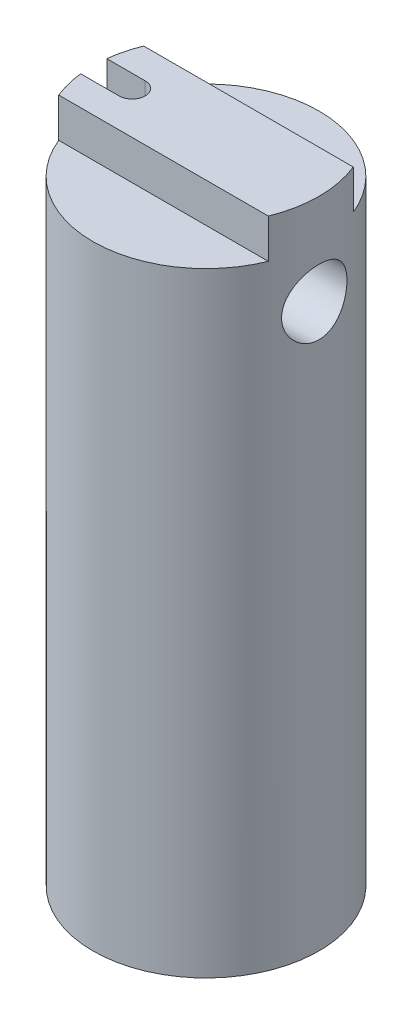
ISO-10303-21;
HEADER;
FILE_DESCRIPTION(('STEP AP214'),'2;1');
FILE_NAME('part.step','',(''),(''),'','','');
FILE_SCHEMA(('AUTOMOTIVE_DESIGN { 1 0 10303 214 1 1 1 1 }'));
ENDSEC;
DATA;
#1=APPLICATION_CONTEXT('core data for automotive mechanical design processes');
#2=APPLICATION_PROTOCOL_DEFINITION('international standard','automotive_design',2000,#1);
#3=PRODUCT_CONTEXT('',#1,'mechanical');
#4=PRODUCT('Part','Part','',(#3));
#5=PRODUCT_RELATED_PRODUCT_CATEGORY('part','',(#4));
#6=PRODUCT_DEFINITION_FORMATION('','',#4);
#7=PRODUCT_DEFINITION_CONTEXT('part definition',#1,'design');
#8=PRODUCT_DEFINITION('design','',#6,#7);
#9=PRODUCT_DEFINITION_SHAPE('','',#8);
#10=(LENGTH_UNIT() NAMED_UNIT(*) SI_UNIT(.MILLI.,.METRE.));
#11=(NAMED_UNIT(*) PLANE_ANGLE_UNIT() SI_UNIT($,.RADIAN.));
#12=(NAMED_UNIT(*) SI_UNIT($,.STERADIAN.) SOLID_ANGLE_UNIT());
#13=UNCERTAINTY_MEASURE_WITH_UNIT(LENGTH_MEASURE(1.E-05),#10,'distance_accuracy_value','');
#14=(GEOMETRIC_REPRESENTATION_CONTEXT(3) GLOBAL_UNCERTAINTY_ASSIGNED_CONTEXT((#13)) GLOBAL_UNIT_ASSIGNED_CONTEXT((#10,
#11,#12)) REPRESENTATION_CONTEXT('',''));
#15=CARTESIAN_POINT('',(0.,0.,0.));
#16=DIRECTION('',(0.,0.,1.));
#17=DIRECTION('',(1.,0.,0.));
#18=AXIS2_PLACEMENT_3D('',#15,#16,#17);
#19=CARTESIAN_POINT('',(0.,-50.,0.));
#20=DIRECTION('',(0.,1.,0.));
#21=DIRECTION('',(0.,0.,1.));
#22=AXIS2_PLACEMENT_3D('',#19,#20,#21);
#23=CYLINDRICAL_SURFACE('',#22,8.65000000000001);
#24=CARTESIAN_POINT('',(8.28085140550174,-7.,-2.49999999999999));
#25=CARTESIAN_POINT('',(8.28085322376039,-6.86275889358771,-2.49999769228479));
#26=CARTESIAN_POINT('',(8.28430054332778,-6.72549461628499,-2.48866045927901));
#27=CARTESIAN_POINT('',(8.2976670899937,-6.45496245214444,-2.44371720208671));
#28=CARTESIAN_POINT('',(8.30758884133336,-6.32169614523445,-2.41010249231336));
#29=CARTESIAN_POINT('',(8.33268872764418,-6.06311422261727,-2.32182760939016));
#30=CARTESIAN_POINT('',(8.34785858328595,-5.93778644946403,-2.26720056987894));
#31=CARTESIAN_POINT('',(8.38173444287658,-5.69804713837223,-2.13855897619452));
#32=CARTESIAN_POINT('',(8.40044089191065,-5.58363697716041,-2.06454198131571));
#33=CARTESIAN_POINT('',(8.43989824325808,-5.36562032598627,-1.89689487117158));
#34=CARTESIAN_POINT('',(8.46069027844958,-5.26238194617315,-1.80279562216665));
#35=CARTESIAN_POINT('',(8.50162347229231,-5.07290963685424,-1.59866174479604));
#36=CARTESIAN_POINT('',(8.52176455283785,-4.98667774160831,-1.48862521279191));
#37=CARTESIAN_POINT('',(8.55959091954456,-4.83208950058936,-1.25314418411789));
#38=CARTESIAN_POINT('',(8.57722206612258,-4.76410528932715,-1.12744593317654));
#39=CARTESIAN_POINT('',(8.60756615481593,-4.65037988823474,-0.865806137571206));
#40=CARTESIAN_POINT('',(8.62028007768423,-4.60463426239299,-0.729866642019158));
#41=CARTESIAN_POINT('',(8.63906623394997,-4.53789359716114,-0.455451452356293));
#42=CARTESIAN_POINT('',(8.64530657227224,-4.5162709443423,-0.317140114448814));
#43=CARTESIAN_POINT('',(8.65103299621578,-4.49640888690367,-0.0387215687059775));
#44=CARTESIAN_POINT('',(8.65052040187899,-4.49816491229442,0.101385282798723));
#45=CARTESIAN_POINT('',(8.6429190331002,-4.52458200293445,0.375026599869924));
#46=CARTESIAN_POINT('',(8.6360252374013,-4.54856397684487,0.508632884649997));
#47=CARTESIAN_POINT('',(8.61667065260533,-4.61764708793833,0.769836720116405));
#48=CARTESIAN_POINT('',(8.60420952141952,-4.6627495228908,0.897433901036584));
#49=CARTESIAN_POINT('',(8.57484418518508,-4.7732734448961,1.14465227980842));
#50=CARTESIAN_POINT('',(8.55789218916658,-4.83891495431073,1.26416920176256));
#51=CARTESIAN_POINT('',(8.52135310844036,-4.98848155042203,1.49071374952026));
#52=CARTESIAN_POINT('',(8.50176543559973,-5.07241072047892,1.5977385778176));
#53=CARTESIAN_POINT('',(8.46123095697068,-5.25972125834663,1.80031492214499));
#54=CARTESIAN_POINT('',(8.44026060223056,-5.36369254293566,1.89531696591399));
#55=CARTESIAN_POINT('',(8.39994547788299,-5.58630076609,2.066684950439));
#56=CARTESIAN_POINT('',(8.3806008467113,-5.70493895146947,2.14304930518591));
#57=CARTESIAN_POINT('',(8.34562064374236,-5.95487175612977,2.27549291299663));
#58=CARTESIAN_POINT('',(8.33001733288379,-6.08626363006372,2.33139777376546));
#59=CARTESIAN_POINT('',(8.3046741970681,-6.3571496169274,2.42013226280127));
#60=CARTESIAN_POINT('',(8.29493261974098,-6.49664129472688,2.45296878785813));
#61=CARTESIAN_POINT('',(8.28279676206013,-6.77456817162309,2.49363498431357));
#62=CARTESIAN_POINT('',(8.28015874382514,-6.91287140149247,2.50229461475222));
#63=CARTESIAN_POINT('',(8.2818570952544,-7.18895519418841,2.49666841228663));
#64=CARTESIAN_POINT('',(8.28619257120024,-7.32673582172305,2.4823855196813));
#65=CARTESIAN_POINT('',(8.30111144335729,-7.59449342913186,2.43201645868713));
#66=CARTESIAN_POINT('',(8.31154507352058,-7.72457781669547,2.39645245580023));
#67=CARTESIAN_POINT('',(8.33733248636691,-7.97692857106371,2.30512983258329));
#68=CARTESIAN_POINT('',(8.35268699053245,-8.09919378829191,2.2493682507939));
#69=CARTESIAN_POINT('',(8.3870680997782,-8.33584418852758,2.11762173240531));
#70=CARTESIAN_POINT('',(8.40617756772015,-8.44995277988932,2.04116211759291));
#71=CARTESIAN_POINT('',(8.4457318258527,-8.66402381235529,1.87076193412246));
#72=CARTESIAN_POINT('',(8.46617691167614,-8.76398310596633,1.77681748671075));
#73=CARTESIAN_POINT('',(8.50695656464454,-8.95048464614675,1.57023366032182));
#74=CARTESIAN_POINT('',(8.52726273302557,-9.03644167951082,1.45705911465026));
#75=CARTESIAN_POINT('',(8.56475831258217,-9.1881510131364,1.2174158958495));
#76=CARTESIAN_POINT('',(8.58194788525379,-9.25390436043724,1.09094791209778));
#77=CARTESIAN_POINT('',(8.61116483842541,-9.36270966992412,0.829176090527664));
#78=CARTESIAN_POINT('',(8.62323110853566,-9.40593324239973,0.693948139322728));
#79=CARTESIAN_POINT('',(8.64101371064214,-9.46891538769943,0.417740144326336));
#80=CARTESIAN_POINT('',(8.64673171743505,-9.48868014951411,0.276761627827327));
#81=CARTESIAN_POINT('',(8.65107930152753,-9.50374075806176,-0.00151823492443659));
#82=CARTESIAN_POINT('',(8.64995564337549,-9.49988839002659,-0.138770225457254));
#83=CARTESIAN_POINT('',(8.64131972256357,-9.4698403531093,-0.41058960183081));
#84=CARTESIAN_POINT('',(8.63380777832634,-9.4436457978682,-0.54515712113625));
#85=CARTESIAN_POINT('',(8.61330271008766,-9.37016979152791,-0.806575458170936));
#86=CARTESIAN_POINT('',(8.60036140915817,-9.32308747559144,-0.933486586325141));
#87=CARTESIAN_POINT('',(8.57034000082596,-9.20934971696781,-1.17767733386419));
#88=CARTESIAN_POINT('',(8.55325924315235,-9.14269119868902,-1.29495543610907));
#89=CARTESIAN_POINT('',(8.5161214057924,-8.98934945085336,-1.52040539398673));
#90=CARTESIAN_POINT('',(8.49598989406107,-8.90212123783287,-1.62819423311826));
#91=CARTESIAN_POINT('',(8.45527783091918,-8.71111518887002,-1.82789062235672));
#92=CARTESIAN_POINT('',(8.43469715566095,-8.60733273737311,-1.91979372836344));
#93=CARTESIAN_POINT('',(8.39476598761253,-8.38279055628811,-2.08759650932855));
#94=CARTESIAN_POINT('',(8.37546385378877,-8.26164741480997,-2.16299583453981));
#95=CARTESIAN_POINT('',(8.34101541303892,-8.00786333984392,-2.29226184120731));
#96=CARTESIAN_POINT('',(8.32586685481773,-7.87522868642315,-2.34614019458919));
#97=CARTESIAN_POINT('',(8.30314969949933,-7.61959099223756,-2.42521604453701));
#98=CARTESIAN_POINT('',(8.29486282049023,-7.49750372993507,-2.4531868369833));
#99=CARTESIAN_POINT('',(8.28371329696176,-7.25028372678931,-2.49057831939011));
#100=CARTESIAN_POINT('',(8.28084974741402,-7.12515149761131,-2.5000021044279));
#101=CARTESIAN_POINT('',(8.28085140550174,-7.,-2.49999999999999));
#102=B_SPLINE_CURVE_WITH_KNOTS('',3,(#24,#25,#26,#27,#28,#29,#30,#31,#32,#33,#34,#35,#36,#37,
#38,#39,#40,#41,#42,#43,#44,#45,#46,#47,#48,#49,#50,#51,#52,#53,#54,#55,#56,#57,#58,#59,#60,#61,
#62,#63,#64,#65,#66,#67,#68,#69,#70,#71,#72,#73,#74,#75,#76,#77,#78,#79,#80,#81,#82,#83,#84,#85,
#86,#87,#88,#89,#90,#91,#92,#93,#94,#95,#96,#97,#98,#99,#100,#101),.UNSPECIFIED.,.T.,.F.,(4,2,2,
2,2,2,2,2,2,2,2,2,2,2,2,2,2,2,2,2,2,2,2,2,2,2,2,2,2,2,2,2,2,2,2,2,2,2,4),(0.,0.411262171979639,
0.822684782074835,1.23346127574435,1.6442895006641,2.06604041547225,2.48784174818307,
2.9176846054889,3.34744168525811,3.76573611038611,4.18394876985462,4.58979026664504,
4.99565670407505,5.4060290563878,5.81649313275795,6.24168527722219,6.66691359160376,
7.0956863964371,7.52433095552636,7.93806836379586,8.35175275197718,8.75568057143647,
9.15966764058979,9.57384586871271,9.98811608594928,10.4167468573414,10.8453554115503,
11.2706496844102,11.6958317295967,12.1057714274345,12.5156906931192,12.9217832420427,
13.3279396257996,13.7463881494923,14.1649535471111,14.5948453531576,15.0245036892449,
15.3996002578841,15.7746342260562),.UNSPECIFIED.);
#103=CARTESIAN_POINT('',(8.28085140550174,-7.,-2.49999999999999));
#104=VERTEX_POINT('',#103);
#105=EDGE_CURVE('E11',#104,#104,#102,.T.);
#106=ORIENTED_EDGE('',*,*,#105,.F.);
#107=EDGE_LOOP('',(#106));
#108=FACE_BOUND('',#107,.T.);
#109=DIRECTION('',(0.,1.,0.));
#110=VECTOR('',#109,1.);
#111=CARTESIAN_POINT('',(-8.01623352953244,-50.,3.25));
#112=LINE('',#111,#110);
#113=CARTESIAN_POINT('',(-8.01623352953244,0.,3.25));
#114=VERTEX_POINT('',#113);
#115=CARTESIAN_POINT('',(-8.01623352953244,-3.,3.25));
#116=VERTEX_POINT('',#115);
#117=EDGE_CURVE('E156',#114,#116,#112,.F.);
#118=ORIENTED_EDGE('',*,*,#117,.F.);
#119=CARTESIAN_POINT('',(0.,0.,0.));
#120=DIRECTION('',(0.,1.,0.));
#121=DIRECTION('',(0.,0.,1.));
#122=AXIS2_PLACEMENT_3D('',#119,#120,#121);
#123=CIRCLE('',#122,8.65000000000001);
#124=CARTESIAN_POINT('',(-8.59200209497182,0.,1.));
#125=VERTEX_POINT('',#124);
#126=EDGE_CURVE('E205',#125,#114,#123,.T.);
#127=ORIENTED_EDGE('',*,*,#126,.F.);
#128=DIRECTION('',(0.,1.,0.));
#129=VECTOR('',#128,1.);
#130=CARTESIAN_POINT('',(-8.59200209497182,-50.,1.));
#131=LINE('',#130,#129);
#132=CARTESIAN_POINT('',(-8.59200209497182,-10.,1.));
#133=VERTEX_POINT('',#132);
#134=EDGE_CURVE('E174',#125,#133,#131,.F.);
#135=ORIENTED_EDGE('',*,*,#134,.T.);
#136=CARTESIAN_POINT('',(0.,-10.,0.));
#137=DIRECTION('',(0.,-1.,0.));
#138=DIRECTION('',(0.,0.,-1.));
#139=AXIS2_PLACEMENT_3D('',#136,#137,#138);
#140=CIRCLE('',#139,8.65000000000001);
#141=CARTESIAN_POINT('',(-8.11310667993464,-10.,3.));
#142=VERTEX_POINT('',#141);
#143=EDGE_CURVE('E211',#133,#142,#140,.F.);
#144=ORIENTED_EDGE('',*,*,#143,.T.);
#145=DIRECTION('',(0.,1.,0.));
#146=VECTOR('',#145,1.);
#147=CARTESIAN_POINT('',(-8.11310667993464,-50.,3.));
#148=LINE('',#147,#146);
#149=CARTESIAN_POINT('',(-8.11310667993464,-50.,3.));
#150=VERTEX_POINT('',#149);
#151=EDGE_CURVE('E193',#150,#142,#148,.T.);
#152=ORIENTED_EDGE('',*,*,#151,.F.);
#153=CARTESIAN_POINT('',(0.,-50.,0.));
#154=DIRECTION('',(0.,1.,0.));
#155=DIRECTION('',(0.,0.,1.));
#156=AXIS2_PLACEMENT_3D('',#153,#154,#155);
#157=CIRCLE('',#156,8.65000000000001);
#158=CARTESIAN_POINT('',(-8.11310667993464,-50.,-3.));
#159=VERTEX_POINT('',#158);
#160=EDGE_CURVE('E201',#150,#159,#157,.T.);
#161=ORIENTED_EDGE('',*,*,#160,.T.);
#162=DIRECTION('',(0.,1.,0.));
#163=VECTOR('',#162,1.);
#164=CARTESIAN_POINT('',(-8.11310667993464,-50.,-3.));
#165=LINE('',#164,#163);
#166=CARTESIAN_POINT('',(-8.11310667993464,-10.,-3.));
#167=VERTEX_POINT('',#166);
#168=EDGE_CURVE('E198',#167,#159,#165,.F.);
#169=ORIENTED_EDGE('',*,*,#168,.F.);
#170=CARTESIAN_POINT('',(-8.59200209497182,-10.,-1.));
#171=VERTEX_POINT('',#170);
#172=EDGE_CURVE('E212',#167,#171,#140,.F.);
#173=ORIENTED_EDGE('',*,*,#172,.T.);
#174=DIRECTION('',(0.,1.,0.));
#175=VECTOR('',#174,1.);
#176=CARTESIAN_POINT('',(-8.59200209497182,-50.,-1.));
#177=LINE('',#176,#175);
#178=CARTESIAN_POINT('',(-8.59200209497182,0.,-1.));
#179=VERTEX_POINT('',#178);
#180=EDGE_CURVE('E171',#171,#179,#177,.T.);
#181=ORIENTED_EDGE('',*,*,#180,.T.);
#182=CARTESIAN_POINT('',(-8.01623352953244,0.,-3.25));
#183=VERTEX_POINT('',#182);
#184=EDGE_CURVE('E200',#183,#179,#123,.T.);
#185=ORIENTED_EDGE('',*,*,#184,.F.);
#186=DIRECTION('',(0.,1.,0.));
#187=VECTOR('',#186,1.);
#188=CARTESIAN_POINT('',(-8.0162335295323,-50.,-3.25000000000035));
#189=LINE('',#188,#187);
#190=CARTESIAN_POINT('',(-8.0162335295323,-3.,-3.25000000000002));
#191=VERTEX_POINT('',#190);
#192=EDGE_CURVE('E58',#191,#183,#189,.T.);
#193=ORIENTED_EDGE('',*,*,#192,.F.);
#194=CARTESIAN_POINT('',(0.,-3.,0.));
#195=DIRECTION('',(0.,-1.,0.));
#196=DIRECTION('',(0.,0.,-1.));
#197=AXIS2_PLACEMENT_3D('',#194,#195,#196);
#198=CIRCLE('',#197,8.65000000000001);
#199=CARTESIAN_POINT('',(8.0162335295323,-3.,-3.25000000000002));
#200=VERTEX_POINT('',#199);
#201=EDGE_CURVE('E228',#200,#191,#198,.F.);
#202=ORIENTED_EDGE('',*,*,#201,.F.);
#203=DIRECTION('',(0.,1.,0.));
#204=VECTOR('',#203,1.);
#205=CARTESIAN_POINT('',(8.0162335295323,-50.,-3.25000000000035));
#206=LINE('',#205,#204);
#207=CARTESIAN_POINT('',(8.01623352953244,0.,-3.25));
#208=VERTEX_POINT('',#207);
#209=EDGE_CURVE('E153',#208,#200,#206,.F.);
#210=ORIENTED_EDGE('',*,*,#209,.F.);
#211=CARTESIAN_POINT('',(8.01623352953244,0.,3.25));
#212=VERTEX_POINT('',#211);
#213=EDGE_CURVE('E208',#212,#208,#123,.T.);
#214=ORIENTED_EDGE('',*,*,#213,.F.);
#215=DIRECTION('',(0.,1.,0.));
#216=VECTOR('',#215,1.);
#217=CARTESIAN_POINT('',(8.01623352953244,-50.,3.25));
#218=LINE('',#217,#216);
#219=CARTESIAN_POINT('',(8.01623352953244,-3.,3.25));
#220=VERTEX_POINT('',#219);
#221=EDGE_CURVE('E66',#220,#212,#218,.T.);
#222=ORIENTED_EDGE('',*,*,#221,.F.);
#223=CARTESIAN_POINT('',(0.,-3.,0.));
#224=DIRECTION('',(0.,-1.,0.));
#225=DIRECTION('',(0.,0.,-1.));
#226=AXIS2_PLACEMENT_3D('',#223,#224,#225);
#227=CIRCLE('',#226,8.65000000000001);
#228=EDGE_CURVE('E51',#116,#220,#227,.F.);
#229=ORIENTED_EDGE('',*,*,#228,.F.);
#230=EDGE_LOOP('',(#118,#127,#135,#144,#152,#161,#169,#173,#181,#185,#193,#202,#210,#214,#222,#229));
#231=FACE_BOUND('',#230,.T.);
#232=ADVANCED_FACE('F39',(#108,#231),#23,.T.);
#233=CARTESIAN_POINT('',(0.,0.,0.));
#234=DIRECTION('',(0.,1.,0.));
#235=DIRECTION('',(0.,0.,1.));
#236=AXIS2_PLACEMENT_3D('',#233,#234,#235);
#237=PLANE('',#236);
#238=DIRECTION('',(-1.,0.,0.));
#239=VECTOR('',#238,1.);
#240=CARTESIAN_POINT('',(0.,0.,3.25));
#241=LINE('',#240,#239);
#242=EDGE_CURVE('E226',#212,#114,#241,.T.);
#243=ORIENTED_EDGE('',*,*,#242,.F.);
#244=ORIENTED_EDGE('',*,*,#213,.T.);
#245=DIRECTION('',(1.,0.,0.));
#246=VECTOR('',#245,1.);
#247=CARTESIAN_POINT('',(0.,0.,-3.25));
#248=LINE('',#247,#246);
#249=EDGE_CURVE('E224',#183,#208,#248,.T.);
#250=ORIENTED_EDGE('',*,*,#249,.F.);
#251=ORIENTED_EDGE('',*,*,#184,.T.);
#252=DIRECTION('',(1.,0.,0.));
#253=VECTOR('',#252,1.);
#254=CARTESIAN_POINT('',(-5.65,0.,-1.));
#255=LINE('',#254,#253);
#256=CARTESIAN_POINT('',(-5.65,0.,-1.));
#257=VERTEX_POINT('',#256);
#258=EDGE_CURVE('E164',#179,#257,#255,.T.);
#259=ORIENTED_EDGE('',*,*,#258,.T.);
#260=CARTESIAN_POINT('',(-5.65,0.,0.));
#261=DIRECTION('',(0.,-1.,0.));
#262=DIRECTION('',(0.,0.,-1.));
#263=AXIS2_PLACEMENT_3D('',#260,#261,#262);
#264=CIRCLE('',#263,1.);
#265=CARTESIAN_POINT('',(-5.65,0.,1.));
#266=VERTEX_POINT('',#265);
#267=EDGE_CURVE('E158',#257,#266,#264,.T.);
#268=ORIENTED_EDGE('',*,*,#267,.T.);
#269=DIRECTION('',(-1.,0.,0.));
#270=VECTOR('',#269,1.);
#271=CARTESIAN_POINT('',(-5.65,0.,1.));
#272=LINE('',#271,#270);
#273=EDGE_CURVE('E161',#266,#125,#272,.T.);
#274=ORIENTED_EDGE('',*,*,#273,.T.);
#275=ORIENTED_EDGE('',*,*,#126,.T.);
#276=EDGE_LOOP('',(#243,#244,#250,#251,#259,#268,#274,#275));
#277=FACE_BOUND('',#276,.T.);
#278=ADVANCED_FACE('F242',(#277),#237,.T.);
#279=CARTESIAN_POINT('',(-5.65,-10.,0.));
#280=DIRECTION('',(0.,-1.,0.));
#281=DIRECTION('',(0.,0.,-1.));
#282=AXIS2_PLACEMENT_3D('',#279,#280,#281);
#283=PLANE('',#282);
#284=ORIENTED_EDGE('',*,*,#143,.F.);
#285=DIRECTION('',(1.,0.,0.));
#286=VECTOR('',#285,1.);
#287=CARTESIAN_POINT('',(-5.65,-10.,1.));
#288=LINE('',#287,#286);
#289=CARTESIAN_POINT('',(-5.65,-10.,1.));
#290=VERTEX_POINT('',#289);
#291=EDGE_CURVE('E221',#133,#290,#288,.T.);
#292=ORIENTED_EDGE('',*,*,#291,.T.);
#293=CARTESIAN_POINT('',(-5.65,-10.,0.));
#294=DIRECTION('',(0.,-1.,0.));
#295=DIRECTION('',(0.,0.,-1.));
#296=AXIS2_PLACEMENT_3D('',#293,#294,#295);
#297=CIRCLE('',#296,1.);
#298=CARTESIAN_POINT('',(-5.65,-10.,-1.));
#299=VERTEX_POINT('',#298);
#300=EDGE_CURVE('E218',#290,#299,#297,.F.);
#301=ORIENTED_EDGE('',*,*,#300,.T.);
#302=DIRECTION('',(-1.,0.,0.));
#303=VECTOR('',#302,1.);
#304=CARTESIAN_POINT('',(-5.65,-10.,-1.));
#305=LINE('',#304,#303);
#306=EDGE_CURVE('E215',#299,#171,#305,.T.);
#307=ORIENTED_EDGE('',*,*,#306,.T.);
#308=ORIENTED_EDGE('',*,*,#172,.F.);
#309=DIRECTION('',(1.,0.,0.));
#310=VECTOR('',#309,1.);
#311=CARTESIAN_POINT('',(-5.65,-10.,-3.));
#312=LINE('',#311,#310);
#313=CARTESIAN_POINT('',(-5.65,-10.,-3.));
#314=VERTEX_POINT('',#313);
#315=EDGE_CURVE('E185',#167,#314,#312,.T.);
#316=ORIENTED_EDGE('',*,*,#315,.T.);
#317=CARTESIAN_POINT('',(-5.65,-10.,0.));
#318=DIRECTION('',(0.,-1.,0.));
#319=DIRECTION('',(0.,0.,-1.));
#320=AXIS2_PLACEMENT_3D('',#317,#318,#319);
#321=CIRCLE('',#320,3.);
#322=CARTESIAN_POINT('',(-5.65000000000001,-10.,3.));
#323=VERTEX_POINT('',#322);
#324=EDGE_CURVE('E178',#314,#323,#321,.T.);
#325=ORIENTED_EDGE('',*,*,#324,.T.);
#326=DIRECTION('',(-1.,0.,0.));
#327=VECTOR('',#326,1.);
#328=CARTESIAN_POINT('',(-5.65000000000001,-10.,3.));
#329=LINE('',#328,#327);
#330=EDGE_CURVE('E181',#323,#142,#329,.T.);
#331=ORIENTED_EDGE('',*,*,#330,.T.);
#332=EDGE_LOOP('',(#284,#292,#301,#307,#308,#316,#325,#331));
#333=FACE_BOUND('',#332,.T.);
#334=ADVANCED_FACE('F251',(#333),#283,.T.);
#335=CARTESIAN_POINT('',(0.,-50.,0.));
#336=DIRECTION('',(0.,1.,0.));
#337=DIRECTION('',(0.,0.,1.));
#338=AXIS2_PLACEMENT_3D('',#335,#336,#337);
#339=PLANE('',#338);
#340=CARTESIAN_POINT('',(-5.65,-50.,0.));
#341=DIRECTION('',(0.,-1.,0.));
#342=DIRECTION('',(0.,0.,-1.));
#343=AXIS2_PLACEMENT_3D('',#340,#341,#342);
#344=CIRCLE('',#343,3.);
#345=CARTESIAN_POINT('',(-5.65,-50.,-3.));
#346=VERTEX_POINT('',#345);
#347=CARTESIAN_POINT('',(-5.65000000000001,-50.,3.));
#348=VERTEX_POINT('',#347);
#349=EDGE_CURVE('E177',#346,#348,#344,.T.);
#350=ORIENTED_EDGE('',*,*,#349,.F.);
#351=DIRECTION('',(-1.,0.,0.));
#352=VECTOR('',#351,1.);
#353=CARTESIAN_POINT('',(0.,-50.,-3.));
#354=LINE('',#353,#352);
#355=EDGE_CURVE('E204',#346,#159,#354,.T.);
#356=ORIENTED_EDGE('',*,*,#355,.T.);
#357=ORIENTED_EDGE('',*,*,#160,.F.);
#358=DIRECTION('',(-1.,0.,0.));
#359=VECTOR('',#358,1.);
#360=CARTESIAN_POINT('',(-5.65000000000001,-50.,3.));
#361=LINE('',#360,#359);
#362=EDGE_CURVE('E182',#348,#150,#361,.T.);
#363=ORIENTED_EDGE('',*,*,#362,.F.);
#364=EDGE_LOOP('',(#350,#356,#357,#363));
#365=FACE_BOUND('',#364,.T.);
#366=ADVANCED_FACE('F266',(#365),#339,.F.);
#367=CARTESIAN_POINT('',(-5.65,-10.,0.));
#368=DIRECTION('',(0.,-1.,0.));
#369=DIRECTION('',(0.,0.,-1.));
#370=AXIS2_PLACEMENT_3D('',#367,#368,#369);
#371=CYLINDRICAL_SURFACE('',#370,3.);
#372=ORIENTED_EDGE('',*,*,#349,.T.);
#373=DIRECTION('',(0.,-1.,0.));
#374=VECTOR('',#373,1.);
#375=CARTESIAN_POINT('',(-5.65000000000001,-10.,3.));
#376=LINE('',#375,#374);
#377=EDGE_CURVE('E187',#323,#348,#376,.T.);
#378=ORIENTED_EDGE('',*,*,#377,.F.);
#379=ORIENTED_EDGE('',*,*,#324,.F.);
#380=DIRECTION('',(0.,-1.,0.));
#381=VECTOR('',#380,1.);
#382=CARTESIAN_POINT('',(-5.65,-10.,-3.));
#383=LINE('',#382,#381);
#384=EDGE_CURVE('E190',#314,#346,#383,.T.);
#385=ORIENTED_EDGE('',*,*,#384,.T.);
#386=EDGE_LOOP('',(#372,#378,#379,#385));
#387=FACE_BOUND('',#386,.T.);
#388=ADVANCED_FACE('F258',(#387),#371,.F.);
#389=CARTESIAN_POINT('',(-5.65,-10.,-3.));
#390=DIRECTION('',(0.,0.,-1.));
#391=DIRECTION('',(-1.,0.,0.));
#392=AXIS2_PLACEMENT_3D('',#389,#390,#391);
#393=PLANE('',#392);
#394=ORIENTED_EDGE('',*,*,#168,.T.);
#395=ORIENTED_EDGE('',*,*,#355,.F.);
#396=ORIENTED_EDGE('',*,*,#384,.F.);
#397=ORIENTED_EDGE('',*,*,#315,.F.);
#398=EDGE_LOOP('',(#394,#395,#396,#397));
#399=FACE_BOUND('',#398,.T.);
#400=ADVANCED_FACE('F254',(#399),#393,.F.);
#401=CARTESIAN_POINT('',(-5.65000000000001,-10.,3.));
#402=DIRECTION('',(0.,0.,1.));
#403=DIRECTION('',(1.,0.,0.));
#404=AXIS2_PLACEMENT_3D('',#401,#402,#403);
#405=PLANE('',#404);
#406=ORIENTED_EDGE('',*,*,#151,.T.);
#407=ORIENTED_EDGE('',*,*,#330,.F.);
#408=ORIENTED_EDGE('',*,*,#377,.T.);
#409=ORIENTED_EDGE('',*,*,#362,.T.);
#410=EDGE_LOOP('',(#406,#407,#408,#409));
#411=FACE_BOUND('',#410,.T.);
#412=ADVANCED_FACE('F261',(#411),#405,.F.);
#413=CARTESIAN_POINT('',(-5.65,-50.,0.));
#414=DIRECTION('',(0.,1.,0.));
#415=DIRECTION('',(0.,0.,1.));
#416=AXIS2_PLACEMENT_3D('',#413,#414,#415);
#417=CYLINDRICAL_SURFACE('',#416,1.);
#418=DIRECTION('',(0.,1.,0.));
#419=VECTOR('',#418,1.);
#420=CARTESIAN_POINT('',(-5.65,-50.,1.));
#421=LINE('',#420,#419);
#422=EDGE_CURVE('E169',#290,#266,#421,.T.);
#423=ORIENTED_EDGE('',*,*,#422,.T.);
#424=ORIENTED_EDGE('',*,*,#267,.F.);
#425=DIRECTION('',(0.,1.,0.));
#426=VECTOR('',#425,1.);
#427=CARTESIAN_POINT('',(-5.65,-50.,-1.));
#428=LINE('',#427,#426);
#429=EDGE_CURVE('E167',#299,#257,#428,.T.);
#430=ORIENTED_EDGE('',*,*,#429,.F.);
#431=ORIENTED_EDGE('',*,*,#300,.F.);
#432=EDGE_LOOP('',(#423,#424,#430,#431));
#433=FACE_BOUND('',#432,.T.);
#434=ADVANCED_FACE('F303',(#433),#417,.F.);
#435=CARTESIAN_POINT('',(-5.65,-50.,1.));
#436=DIRECTION('',(0.,0.,-1.));
#437=DIRECTION('',(-1.,0.,0.));
#438=AXIS2_PLACEMENT_3D('',#435,#436,#437);
#439=PLANE('',#438);
#440=ORIENTED_EDGE('',*,*,#273,.F.);
#441=ORIENTED_EDGE('',*,*,#422,.F.);
#442=ORIENTED_EDGE('',*,*,#291,.F.);
#443=ORIENTED_EDGE('',*,*,#134,.F.);
#444=EDGE_LOOP('',(#440,#441,#442,#443));
#445=FACE_BOUND('',#444,.T.);
#446=ADVANCED_FACE('F300',(#445),#439,.T.);
#447=CARTESIAN_POINT('',(-5.65,-50.,-1.));
#448=DIRECTION('',(0.,0.,1.));
#449=DIRECTION('',(1.,0.,0.));
#450=AXIS2_PLACEMENT_3D('',#447,#448,#449);
#451=PLANE('',#450);
#452=ORIENTED_EDGE('',*,*,#306,.F.);
#453=ORIENTED_EDGE('',*,*,#429,.T.);
#454=ORIENTED_EDGE('',*,*,#258,.F.);
#455=ORIENTED_EDGE('',*,*,#180,.F.);
#456=EDGE_LOOP('',(#452,#453,#454,#455));
#457=FACE_BOUND('',#456,.T.);
#458=ADVANCED_FACE('F244',(#457),#451,.T.);
#459=CARTESIAN_POINT('',(-8.59200209497182,-3.,-3.25000000000002));
#460=DIRECTION('',(0.,-1.,0.));
#461=DIRECTION('',(0.,0.,-1.));
#462=AXIS2_PLACEMENT_3D('',#459,#460,#461);
#463=PLANE('',#462);
#464=ORIENTED_EDGE('',*,*,#201,.T.);
#465=DIRECTION('',(1.,0.,0.));
#466=VECTOR('',#465,1.);
#467=CARTESIAN_POINT('',(-8.59200209497182,-3.,-3.25000000000002));
#468=LINE('',#467,#466);
#469=EDGE_CURVE('E145',#191,#200,#468,.T.);
#470=ORIENTED_EDGE('',*,*,#469,.T.);
#471=EDGE_LOOP('',(#464,#470));
#472=FACE_BOUND('',#471,.T.);
#473=ADVANCED_FACE('F294',(#472),#463,.F.);
#474=CARTESIAN_POINT('',(-8.59200209497182,-3.,-3.25000000000002));
#475=DIRECTION('',(0.,0.,1.));
#476=DIRECTION('',(0.,-1.,0.));
#477=AXIS2_PLACEMENT_3D('',#474,#475,#476);
#478=PLANE('',#477);
#479=ORIENTED_EDGE('',*,*,#209,.T.);
#480=ORIENTED_EDGE('',*,*,#469,.F.);
#481=ORIENTED_EDGE('',*,*,#192,.T.);
#482=ORIENTED_EDGE('',*,*,#249,.T.);
#483=EDGE_LOOP('',(#479,#480,#481,#482));
#484=FACE_BOUND('',#483,.T.);
#485=ADVANCED_FACE('F291',(#484),#478,.F.);
#486=CARTESIAN_POINT('',(-8.59200209497182,-3.,3.25));
#487=DIRECTION('',(0.,0.,-1.));
#488=DIRECTION('',(-1.,0.,0.));
#489=AXIS2_PLACEMENT_3D('',#486,#487,#488);
#490=PLANE('',#489);
#491=ORIENTED_EDGE('',*,*,#117,.T.);
#492=DIRECTION('',(1.,0.,0.));
#493=VECTOR('',#492,1.);
#494=CARTESIAN_POINT('',(-8.59200209497182,-3.,3.25));
#495=LINE('',#494,#493);
#496=EDGE_CURVE('E148',#116,#220,#495,.T.);
#497=ORIENTED_EDGE('',*,*,#496,.T.);
#498=ORIENTED_EDGE('',*,*,#221,.T.);
#499=ORIENTED_EDGE('',*,*,#242,.T.);
#500=EDGE_LOOP('',(#491,#497,#498,#499));
#501=FACE_BOUND('',#500,.T.);
#502=ADVANCED_FACE('F234',(#501),#490,.F.);
#503=CARTESIAN_POINT('',(-8.59200209497182,-3.,3.25));
#504=DIRECTION('',(0.,-1.,0.));
#505=DIRECTION('',(0.,0.,-1.));
#506=AXIS2_PLACEMENT_3D('',#503,#504,#505);
#507=PLANE('',#506);
#508=ORIENTED_EDGE('',*,*,#228,.T.);
#509=ORIENTED_EDGE('',*,*,#496,.F.);
#510=EDGE_LOOP('',(#508,#509));
#511=FACE_BOUND('',#510,.T.);
#512=ADVANCED_FACE('F139',(#511),#507,.F.);
#513=CARTESIAN_POINT('',(3.65,-7.,0.));
#514=DIRECTION('',(1.,0.,0.));
#515=DIRECTION('',(0.,0.,-1.));
#516=AXIS2_PLACEMENT_3D('',#513,#514,#515);
#517=CONICAL_SURFACE('',#516,2.5,1.02974425867665);
#518=CARTESIAN_POINT('',(2.1478484524311,-7.,0.));
#519=VERTEX_POINT('',#518);
#520=VERTEX_LOOP('',#519);
#521=FACE_BOUND('',#520,.T.);
#522=CARTESIAN_POINT('',(3.65,-7.,0.));
#523=DIRECTION('',(1.,0.,0.));
#524=DIRECTION('',(0.,0.,-1.));
#525=AXIS2_PLACEMENT_3D('',#522,#523,#524);
#526=CIRCLE('',#525,2.5);
#527=CARTESIAN_POINT('',(3.65,-7.,-2.5));
#528=VERTEX_POINT('',#527);
#529=EDGE_CURVE('E143',#528,#528,#526,.T.);
#530=ORIENTED_EDGE('',*,*,#529,.T.);
#531=EDGE_LOOP('',(#530));
#532=FACE_BOUND('',#531,.T.);
#533=ADVANCED_FACE('F135',(#521,#532),#517,.F.);
#534=CARTESIAN_POINT('',(8.65000000000001,-7.,0.));
#535=DIRECTION('',(1.,0.,0.));
#536=DIRECTION('',(0.,0.,-1.));
#537=AXIS2_PLACEMENT_3D('',#534,#535,#536);
#538=CYLINDRICAL_SURFACE('',#537,2.49999999999999);
#539=ORIENTED_EDGE('',*,*,#105,.T.);
#540=EDGE_LOOP('',(#539));
#541=FACE_BOUND('',#540,.T.);
#542=ORIENTED_EDGE('',*,*,#529,.F.);
#543=EDGE_LOOP('',(#542));
#544=FACE_BOUND('',#543,.T.);
#545=ADVANCED_FACE('F138',(#541,#544),#538,.F.);
#546=CLOSED_SHELL('',(#232,#278,#334,#366,#388,#400,#412,#434,#446,#458,#473,#485,#502,#512,
#533,#545));
#547=MANIFOLD_SOLID_BREP('B2',#546);
#548=ADVANCED_BREP_SHAPE_REPRESENTATION('',(#18,#547),#14);
#549=SHAPE_DEFINITION_REPRESENTATION(#9,#548);
ENDSEC;
END-ISO-10303-21;
